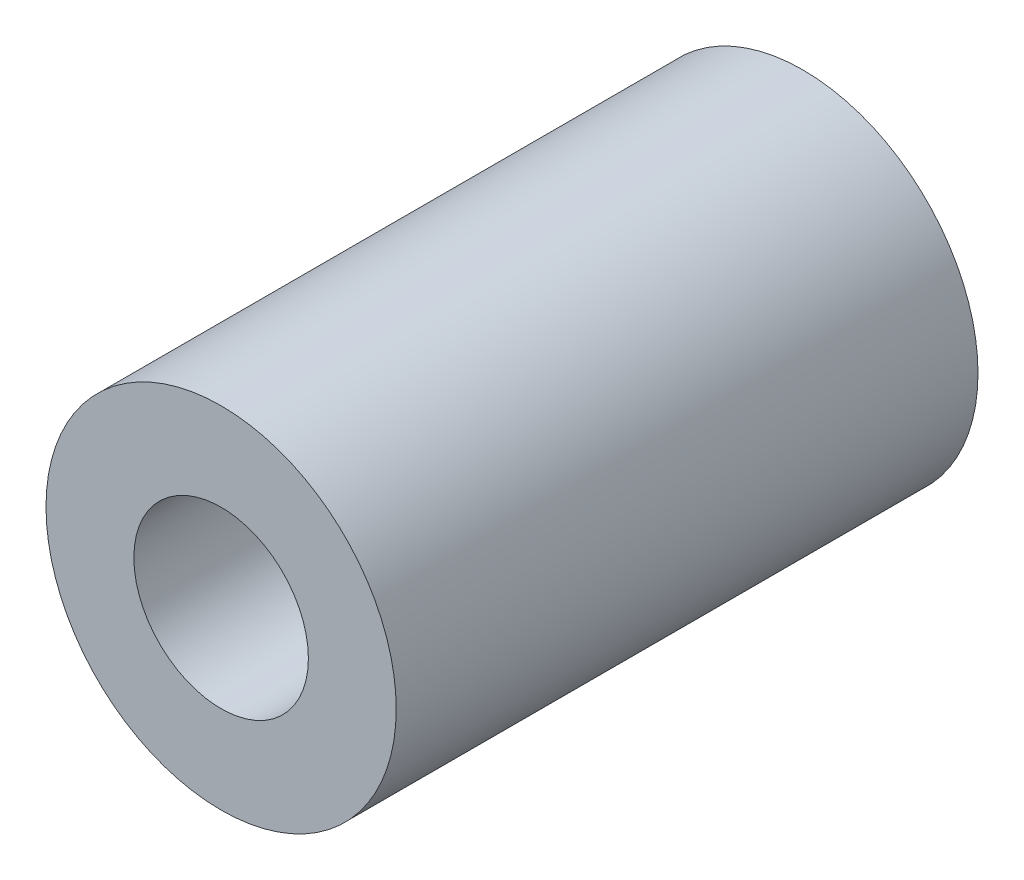
ISO-10303-21;
HEADER;
FILE_DESCRIPTION(('STEP AP214'),'2;1');
FILE_NAME('part.step','',(''),(''),'','','');
FILE_SCHEMA(('AUTOMOTIVE_DESIGN { 1 0 10303 214 1 1 1 1 }'));
ENDSEC;
DATA;
#1=APPLICATION_CONTEXT('core data for automotive mechanical design processes');
#2=APPLICATION_PROTOCOL_DEFINITION('international standard','automotive_design',2000,#1);
#3=PRODUCT_CONTEXT('',#1,'mechanical');
#4=PRODUCT('Part','Part','',(#3));
#5=PRODUCT_RELATED_PRODUCT_CATEGORY('part','',(#4));
#6=PRODUCT_DEFINITION_FORMATION('','',#4);
#7=PRODUCT_DEFINITION_CONTEXT('part definition',#1,'design');
#8=PRODUCT_DEFINITION('design','',#6,#7);
#9=PRODUCT_DEFINITION_SHAPE('','',#8);
#10=(LENGTH_UNIT() NAMED_UNIT(*) SI_UNIT(.MILLI.,.METRE.));
#11=(NAMED_UNIT(*) PLANE_ANGLE_UNIT() SI_UNIT($,.RADIAN.));
#12=(NAMED_UNIT(*) SI_UNIT($,.STERADIAN.) SOLID_ANGLE_UNIT());
#13=UNCERTAINTY_MEASURE_WITH_UNIT(LENGTH_MEASURE(1.E-05),#10,'distance_accuracy_value','');
#14=(GEOMETRIC_REPRESENTATION_CONTEXT(3) GLOBAL_UNCERTAINTY_ASSIGNED_CONTEXT((#13)) GLOBAL_UNIT_ASSIGNED_CONTEXT((#10,
#11,#12)) REPRESENTATION_CONTEXT('',''));
#15=CARTESIAN_POINT('',(0.,0.,0.));
#16=DIRECTION('',(0.,0.,1.));
#17=DIRECTION('',(1.,0.,0.));
#18=AXIS2_PLACEMENT_3D('',#15,#16,#17);
#19=CARTESIAN_POINT('',(0.,0.,5.));
#20=DIRECTION('',(0.,0.,1.));
#21=DIRECTION('',(1.,0.,0.));
#22=AXIS2_PLACEMENT_3D('',#19,#20,#21);
#23=PLANE('',#22);
#24=CARTESIAN_POINT('',(0.,0.,5.));
#25=DIRECTION('',(0.,0.,1.));
#26=DIRECTION('',(1.,0.,0.));
#27=AXIS2_PLACEMENT_3D('',#24,#25,#26);
#28=CIRCLE('',#27,3.01);
#29=CARTESIAN_POINT('',(3.01,0.,5.));
#30=VERTEX_POINT('',#29);
#31=EDGE_CURVE('E10',#30,#30,#28,.T.);
#32=ORIENTED_EDGE('',*,*,#31,.T.);
#33=EDGE_LOOP('',(#32));
#34=FACE_BOUND('',#33,.T.);
#35=CARTESIAN_POINT('',(0.,0.,5.));
#36=DIRECTION('',(0.,0.,1.));
#37=DIRECTION('',(1.,0.,0.));
#38=AXIS2_PLACEMENT_3D('',#35,#36,#37);
#39=CIRCLE('',#38,1.5);
#40=CARTESIAN_POINT('',(1.5,0.,5.));
#41=VERTEX_POINT('',#40);
#42=EDGE_CURVE('E46',#41,#41,#39,.T.);
#43=ORIENTED_EDGE('',*,*,#42,.F.);
#44=EDGE_LOOP('',(#43));
#45=FACE_BOUND('',#44,.T.);
#46=ADVANCED_FACE('F35',(#34,#45),#23,.T.);
#47=CARTESIAN_POINT('',(0.,0.,-5.));
#48=DIRECTION('',(0.,0.,1.));
#49=DIRECTION('',(1.,0.,0.));
#50=AXIS2_PLACEMENT_3D('',#47,#48,#49);
#51=PLANE('',#50);
#52=CARTESIAN_POINT('',(0.,0.,-5.));
#53=DIRECTION('',(0.,0.,1.));
#54=DIRECTION('',(1.,0.,0.));
#55=AXIS2_PLACEMENT_3D('',#52,#53,#54);
#56=CIRCLE('',#55,3.01);
#57=CARTESIAN_POINT('',(3.01,0.,-5.));
#58=VERTEX_POINT('',#57);
#59=EDGE_CURVE('E39',#58,#58,#56,.T.);
#60=ORIENTED_EDGE('',*,*,#59,.F.);
#61=EDGE_LOOP('',(#60));
#62=FACE_BOUND('',#61,.T.);
#63=CARTESIAN_POINT('',(0.,0.,-5.));
#64=DIRECTION('',(0.,0.,1.));
#65=DIRECTION('',(1.,0.,0.));
#66=AXIS2_PLACEMENT_3D('',#63,#64,#65);
#67=CIRCLE('',#66,1.5);
#68=CARTESIAN_POINT('',(1.5,0.,-5.));
#69=VERTEX_POINT('',#68);
#70=EDGE_CURVE('E48',#69,#69,#67,.T.);
#71=ORIENTED_EDGE('',*,*,#70,.T.);
#72=EDGE_LOOP('',(#71));
#73=FACE_BOUND('',#72,.T.);
#74=ADVANCED_FACE('F58',(#62,#73),#51,.F.);
#75=CARTESIAN_POINT('',(0.,0.,5.));
#76=DIRECTION('',(0.,0.,-1.));
#77=DIRECTION('',(-1.,0.,0.));
#78=AXIS2_PLACEMENT_3D('',#75,#76,#77);
#79=CYLINDRICAL_SURFACE('',#78,3.01);
#80=ORIENTED_EDGE('',*,*,#31,.F.);
#81=EDGE_LOOP('',(#80));
#82=FACE_BOUND('',#81,.T.);
#83=ORIENTED_EDGE('',*,*,#59,.T.);
#84=EDGE_LOOP('',(#83));
#85=FACE_BOUND('',#84,.T.);
#86=ADVANCED_FACE('F37',(#82,#85),#79,.T.);
#87=CARTESIAN_POINT('',(0.,0.,5.));
#88=DIRECTION('',(0.,0.,-1.));
#89=DIRECTION('',(-1.,0.,0.));
#90=AXIS2_PLACEMENT_3D('',#87,#88,#89);
#91=CYLINDRICAL_SURFACE('',#90,1.5);
#92=ORIENTED_EDGE('',*,*,#42,.T.);
#93=EDGE_LOOP('',(#92));
#94=FACE_BOUND('',#93,.T.);
#95=ORIENTED_EDGE('',*,*,#70,.F.);
#96=EDGE_LOOP('',(#95));
#97=FACE_BOUND('',#96,.T.);
#98=ADVANCED_FACE('F54',(#94,#97),#91,.F.);
#99=CLOSED_SHELL('',(#46,#74,#86,#98));
#100=MANIFOLD_SOLID_BREP('B2',#99);
#101=ADVANCED_BREP_SHAPE_REPRESENTATION('',(#18,#100),#14);
#102=SHAPE_DEFINITION_REPRESENTATION(#9,#101);
ENDSEC;
END-ISO-10303-21;
